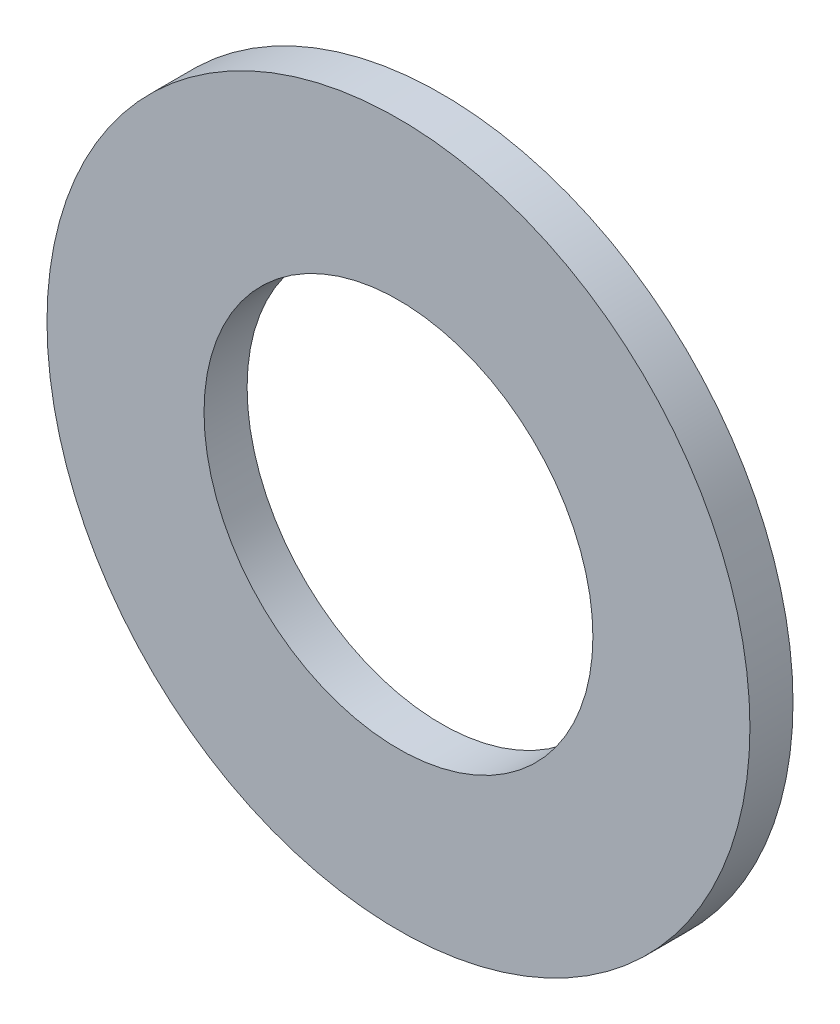
ISO-10303-21;
HEADER;
FILE_DESCRIPTION(('STEP AP214'),'2;1');
FILE_NAME('part.step','',(''),(''),'','','');
FILE_SCHEMA(('AUTOMOTIVE_DESIGN { 1 0 10303 214 1 1 1 1 }'));
ENDSEC;
DATA;
#1=APPLICATION_CONTEXT('core data for automotive mechanical design processes');
#2=APPLICATION_PROTOCOL_DEFINITION('international standard','automotive_design',2000,#1);
#3=PRODUCT_CONTEXT('',#1,'mechanical');
#4=PRODUCT('Part','Part','',(#3));
#5=PRODUCT_RELATED_PRODUCT_CATEGORY('part','',(#4));
#6=PRODUCT_DEFINITION_FORMATION('','',#4);
#7=PRODUCT_DEFINITION_CONTEXT('part definition',#1,'design');
#8=PRODUCT_DEFINITION('design','',#6,#7);
#9=PRODUCT_DEFINITION_SHAPE('','',#8);
#10=(LENGTH_UNIT() NAMED_UNIT(*) SI_UNIT(.MILLI.,.METRE.));
#11=(NAMED_UNIT(*) PLANE_ANGLE_UNIT() SI_UNIT($,.RADIAN.));
#12=(NAMED_UNIT(*) SI_UNIT($,.STERADIAN.) SOLID_ANGLE_UNIT());
#13=UNCERTAINTY_MEASURE_WITH_UNIT(LENGTH_MEASURE(1.E-05),#10,'distance_accuracy_value','');
#14=(GEOMETRIC_REPRESENTATION_CONTEXT(3) GLOBAL_UNCERTAINTY_ASSIGNED_CONTEXT((#13)) GLOBAL_UNIT_ASSIGNED_CONTEXT((#10,
#11,#12)) REPRESENTATION_CONTEXT('',''));
#15=CARTESIAN_POINT('',(0.,0.,0.));
#16=DIRECTION('',(0.,0.,1.));
#17=DIRECTION('',(1.,0.,0.));
#18=AXIS2_PLACEMENT_3D('',#15,#16,#17);
#19=CARTESIAN_POINT('',(0.,0.,-2.286));
#20=DIRECTION('',(0.,0.,1.));
#21=DIRECTION('',(1.,0.,0.));
#22=AXIS2_PLACEMENT_3D('',#19,#20,#21);
#23=CYLINDRICAL_SURFACE('',#22,18.653125);
#24=CARTESIAN_POINT('',(0.,0.,-2.286));
#25=DIRECTION('',(0.,0.,1.));
#26=DIRECTION('',(1.,0.,0.));
#27=AXIS2_PLACEMENT_3D('',#24,#25,#26);
#28=CIRCLE('',#27,18.653125);
#29=CARTESIAN_POINT('',(18.653125,0.,-2.286));
#30=VERTEX_POINT('',#29);
#31=EDGE_CURVE('E10',#30,#30,#28,.T.);
#32=ORIENTED_EDGE('',*,*,#31,.T.);
#33=EDGE_LOOP('',(#32));
#34=FACE_BOUND('',#33,.T.);
#35=CARTESIAN_POINT('',(0.,0.,0.));
#36=DIRECTION('',(0.,0.,1.));
#37=DIRECTION('',(1.,0.,0.));
#38=AXIS2_PLACEMENT_3D('',#35,#36,#37);
#39=CIRCLE('',#38,18.653125);
#40=CARTESIAN_POINT('',(18.653125,0.,0.));
#41=VERTEX_POINT('',#40);
#42=EDGE_CURVE('E36',#41,#41,#39,.T.);
#43=ORIENTED_EDGE('',*,*,#42,.F.);
#44=EDGE_LOOP('',(#43));
#45=FACE_BOUND('',#44,.T.);
#46=ADVANCED_FACE('F33',(#34,#45),#23,.T.);
#47=CARTESIAN_POINT('',(0.,0.,-2.286));
#48=DIRECTION('',(0.,0.,1.));
#49=DIRECTION('',(1.,0.,0.));
#50=AXIS2_PLACEMENT_3D('',#47,#48,#49);
#51=PLANE('',#50);
#52=CARTESIAN_POINT('',(0.,0.,-2.286));
#53=DIRECTION('',(0.,0.,1.));
#54=DIRECTION('',(1.,0.,0.));
#55=AXIS2_PLACEMENT_3D('',#52,#53,#54);
#56=CIRCLE('',#55,10.31875);
#57=CARTESIAN_POINT('',(10.31875,0.,-2.286));
#58=VERTEX_POINT('',#57);
#59=EDGE_CURVE('E43',#58,#58,#56,.T.);
#60=ORIENTED_EDGE('',*,*,#59,.T.);
#61=EDGE_LOOP('',(#60));
#62=FACE_BOUND('',#61,.T.);
#63=ORIENTED_EDGE('',*,*,#31,.F.);
#64=EDGE_LOOP('',(#63));
#65=FACE_BOUND('',#64,.T.);
#66=ADVANCED_FACE('F51',(#62,#65),#51,.F.);
#67=CARTESIAN_POINT('',(0.,0.,0.));
#68=DIRECTION('',(0.,0.,1.));
#69=DIRECTION('',(1.,0.,0.));
#70=AXIS2_PLACEMENT_3D('',#67,#68,#69);
#71=PLANE('',#70);
#72=CARTESIAN_POINT('',(0.,0.,0.));
#73=DIRECTION('',(0.,0.,1.));
#74=DIRECTION('',(1.,0.,0.));
#75=AXIS2_PLACEMENT_3D('',#72,#73,#74);
#76=CIRCLE('',#75,10.31875);
#77=CARTESIAN_POINT('',(10.31875,0.,0.));
#78=VERTEX_POINT('',#77);
#79=EDGE_CURVE('E45',#78,#78,#76,.T.);
#80=ORIENTED_EDGE('',*,*,#79,.F.);
#81=EDGE_LOOP('',(#80));
#82=FACE_BOUND('',#81,.T.);
#83=ORIENTED_EDGE('',*,*,#42,.T.);
#84=EDGE_LOOP('',(#83));
#85=FACE_BOUND('',#84,.T.);
#86=ADVANCED_FACE('F57',(#82,#85),#71,.T.);
#87=CARTESIAN_POINT('',(0.,0.,-2.286));
#88=DIRECTION('',(0.,0.,1.));
#89=DIRECTION('',(1.,0.,0.));
#90=AXIS2_PLACEMENT_3D('',#87,#88,#89);
#91=CYLINDRICAL_SURFACE('',#90,10.31875);
#92=ORIENTED_EDGE('',*,*,#59,.F.);
#93=EDGE_LOOP('',(#92));
#94=FACE_BOUND('',#93,.T.);
#95=ORIENTED_EDGE('',*,*,#79,.T.);
#96=EDGE_LOOP('',(#95));
#97=FACE_BOUND('',#96,.T.);
#98=ADVANCED_FACE('F54',(#94,#97),#91,.F.);
#99=CLOSED_SHELL('',(#46,#66,#86,#98));
#100=MANIFOLD_SOLID_BREP('B2',#99);
#101=ADVANCED_BREP_SHAPE_REPRESENTATION('',(#18,#100),#14);
#102=SHAPE_DEFINITION_REPRESENTATION(#9,#101);
ENDSEC;
END-ISO-10303-21;
